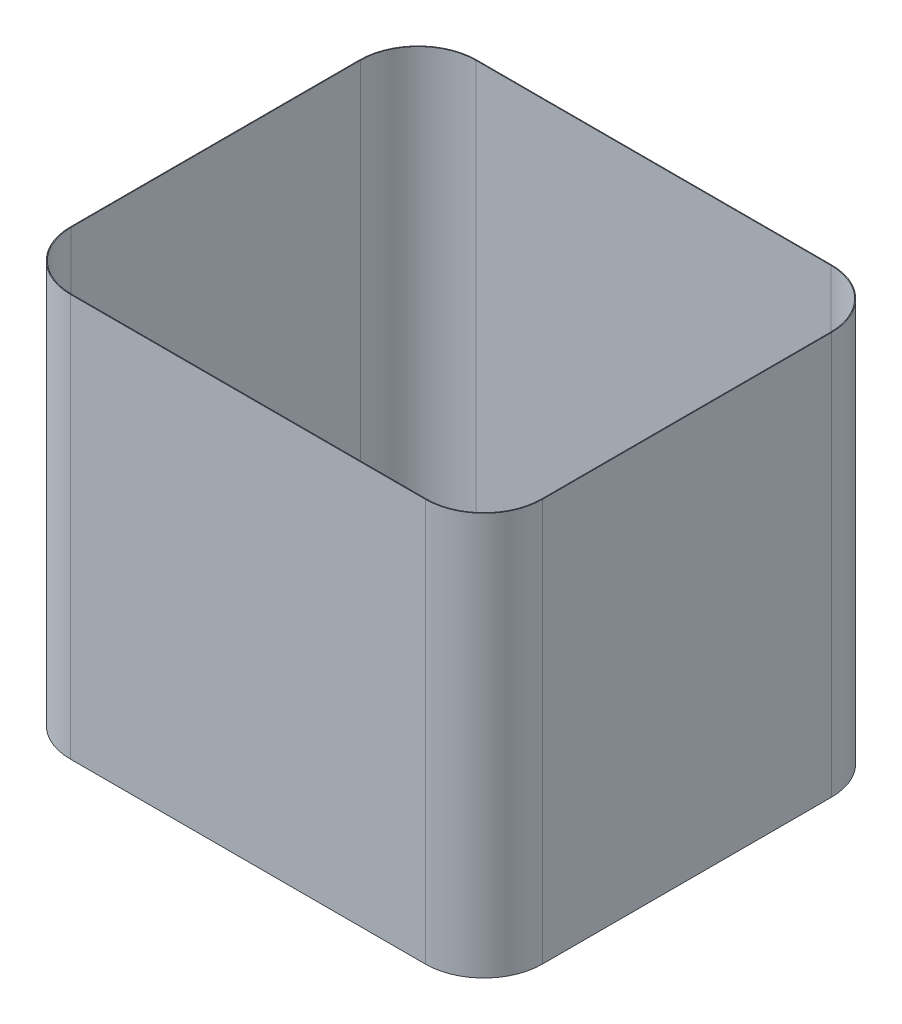
ISO-10303-21;
HEADER;
FILE_DESCRIPTION(('STEP AP214'),'2;1');
FILE_NAME('part.step','',(''),(''),'','','');
FILE_SCHEMA(('AUTOMOTIVE_DESIGN { 1 0 10303 214 1 1 1 1 }'));
ENDSEC;
DATA;
#1=APPLICATION_CONTEXT('core data for automotive mechanical design processes');
#2=APPLICATION_PROTOCOL_DEFINITION('international standard','automotive_design',2000,#1);
#3=PRODUCT_CONTEXT('',#1,'mechanical');
#4=PRODUCT('Part','Part','',(#3));
#5=PRODUCT_RELATED_PRODUCT_CATEGORY('part','',(#4));
#6=PRODUCT_DEFINITION_FORMATION('','',#4);
#7=PRODUCT_DEFINITION_CONTEXT('part definition',#1,'design');
#8=PRODUCT_DEFINITION('design','',#6,#7);
#9=PRODUCT_DEFINITION_SHAPE('','',#8);
#10=(LENGTH_UNIT() NAMED_UNIT(*) SI_UNIT(.MILLI.,.METRE.));
#11=(NAMED_UNIT(*) PLANE_ANGLE_UNIT() SI_UNIT($,.RADIAN.));
#12=(NAMED_UNIT(*) SI_UNIT($,.STERADIAN.) SOLID_ANGLE_UNIT());
#13=UNCERTAINTY_MEASURE_WITH_UNIT(LENGTH_MEASURE(1.E-05),#10,'distance_accuracy_value','');
#14=(GEOMETRIC_REPRESENTATION_CONTEXT(3) GLOBAL_UNCERTAINTY_ASSIGNED_CONTEXT((#13)) GLOBAL_UNIT_ASSIGNED_CONTEXT((#10,
#11,#12)) REPRESENTATION_CONTEXT('',''));
#15=CARTESIAN_POINT('',(0.,0.,0.));
#16=DIRECTION('',(0.,0.,1.));
#17=DIRECTION('',(1.,0.,0.));
#18=AXIS2_PLACEMENT_3D('',#15,#16,#17);
#19=CARTESIAN_POINT('',(-203.2,0.,203.2));
#20=DIRECTION('',(0.,-1.,0.));
#21=DIRECTION('',(0.,0.,-1.));
#22=AXIS2_PLACEMENT_3D('',#19,#20,#21);
#23=PLANE('',#22);
#24=CARTESIAN_POINT('',(-203.2,0.,203.2));
#25=DIRECTION('',(0.,1.,0.));
#26=DIRECTION('',(0.,0.,-1.));
#27=AXIS2_PLACEMENT_3D('',#24,#25,#26);
#28=CIRCLE('',#27,203.2);
#29=CARTESIAN_POINT('',(-406.4,0.,203.199999999999));
#30=VERTEX_POINT('',#29);
#31=CARTESIAN_POINT('',(-203.199999999999,0.,406.4));
#32=VERTEX_POINT('',#31);
#33=EDGE_CURVE('E177',#30,#32,#28,.T.);
#34=ORIENTED_EDGE('',*,*,#33,.F.);
#35=DIRECTION('',(0.,0.,1.));
#36=VECTOR('',#35,1.);
#37=CARTESIAN_POINT('',(-406.4,0.,203.199999999999));
#38=LINE('',#37,#36);
#39=CARTESIAN_POINT('',(-406.4,0.,-800.099999999999));
#40=VERTEX_POINT('',#39);
#41=EDGE_CURVE('E212',#40,#30,#38,.T.);
#42=ORIENTED_EDGE('',*,*,#41,.F.);
#43=CARTESIAN_POINT('',(-203.2,0.,-800.1));
#44=DIRECTION('',(0.,1.,0.));
#45=DIRECTION('',(0.,0.,1.));
#46=AXIS2_PLACEMENT_3D('',#43,#44,#45);
#47=CIRCLE('',#46,203.2);
#48=CARTESIAN_POINT('',(-203.199999999999,0.,-1003.3));
#49=VERTEX_POINT('',#48);
#50=EDGE_CURVE('E239',#49,#40,#47,.T.);
#51=ORIENTED_EDGE('',*,*,#50,.F.);
#52=DIRECTION('',(-1.,0.,0.));
#53=VECTOR('',#52,1.);
#54=CARTESIAN_POINT('',(-203.199999999999,0.,-1003.3));
#55=LINE('',#54,#53);
#56=CARTESIAN_POINT('',(1028.7,0.,-1003.3));
#57=VERTEX_POINT('',#56);
#58=EDGE_CURVE('E237',#57,#49,#55,.T.);
#59=ORIENTED_EDGE('',*,*,#58,.F.);
#60=CARTESIAN_POINT('',(1028.7,0.,-800.1));
#61=DIRECTION('',(0.,1.,0.));
#62=DIRECTION('',(0.,0.,1.));
#63=AXIS2_PLACEMENT_3D('',#60,#61,#62);
#64=CIRCLE('',#63,203.2);
#65=CARTESIAN_POINT('',(1231.9,0.,-800.099999999998));
#66=VERTEX_POINT('',#65);
#67=EDGE_CURVE('E235',#66,#57,#64,.T.);
#68=ORIENTED_EDGE('',*,*,#67,.F.);
#69=DIRECTION('',(0.,0.,-1.));
#70=VECTOR('',#69,1.);
#71=CARTESIAN_POINT('',(1231.9,0.,203.199999999999));
#72=LINE('',#71,#70);
#73=CARTESIAN_POINT('',(1231.9,0.,203.199999999999));
#74=VERTEX_POINT('',#73);
#75=EDGE_CURVE('E233',#74,#66,#72,.T.);
#76=ORIENTED_EDGE('',*,*,#75,.F.);
#77=CARTESIAN_POINT('',(1028.7,0.,203.2));
#78=DIRECTION('',(0.,1.,0.));
#79=DIRECTION('',(0.,0.,1.));
#80=AXIS2_PLACEMENT_3D('',#77,#78,#79);
#81=CIRCLE('',#80,203.2);
#82=CARTESIAN_POINT('',(1028.7,0.,406.4));
#83=VERTEX_POINT('',#82);
#84=EDGE_CURVE('E231',#83,#74,#81,.T.);
#85=ORIENTED_EDGE('',*,*,#84,.F.);
#86=DIRECTION('',(1.,0.,0.));
#87=VECTOR('',#86,1.);
#88=CARTESIAN_POINT('',(-203.199999999999,0.,406.4));
#89=LINE('',#88,#87);
#90=EDGE_CURVE('E229',#32,#83,#89,.T.);
#91=ORIENTED_EDGE('',*,*,#90,.F.);
#92=EDGE_LOOP('',(#34,#42,#51,#59,#68,#76,#85,#91));
#93=FACE_BOUND('',#92,.T.);
#94=DIRECTION('',(0.,0.,1.));
#95=VECTOR('',#94,1.);
#96=CARTESIAN_POINT('',(-403.86,0.,203.2));
#97=LINE('',#96,#95);
#98=CARTESIAN_POINT('',(-403.86,0.,-800.099999999998));
#99=VERTEX_POINT('',#98);
#100=CARTESIAN_POINT('',(-403.86,0.,203.199999999999));
#101=VERTEX_POINT('',#100);
#102=EDGE_CURVE('E158',#99,#101,#97,.T.);
#103=ORIENTED_EDGE('',*,*,#102,.T.);
#104=CARTESIAN_POINT('',(-203.2,0.,203.2));
#105=DIRECTION('',(0.,-1.,0.));
#106=DIRECTION('',(0.,0.,-1.));
#107=AXIS2_PLACEMENT_3D('',#104,#105,#106);
#108=CIRCLE('',#107,200.66);
#109=CARTESIAN_POINT('',(-203.199999999999,0.,403.86));
#110=VERTEX_POINT('',#109);
#111=EDGE_CURVE('E156',#101,#110,#108,.F.);
#112=ORIENTED_EDGE('',*,*,#111,.T.);
#113=DIRECTION('',(1.,0.,0.));
#114=VECTOR('',#113,1.);
#115=CARTESIAN_POINT('',(-203.2,0.,403.86));
#116=LINE('',#115,#114);
#117=CARTESIAN_POINT('',(1028.7,0.,403.86));
#118=VERTEX_POINT('',#117);
#119=EDGE_CURVE('E191',#110,#118,#116,.T.);
#120=ORIENTED_EDGE('',*,*,#119,.T.);
#121=CARTESIAN_POINT('',(1028.7,0.,203.2));
#122=DIRECTION('',(0.,-1.,0.));
#123=DIRECTION('',(0.,0.,-1.));
#124=AXIS2_PLACEMENT_3D('',#121,#122,#123);
#125=CIRCLE('',#124,200.66);
#126=CARTESIAN_POINT('',(1229.36,0.,203.199999999999));
#127=VERTEX_POINT('',#126);
#128=EDGE_CURVE('E58',#118,#127,#125,.F.);
#129=ORIENTED_EDGE('',*,*,#128,.T.);
#130=DIRECTION('',(0.,0.,-1.));
#131=VECTOR('',#130,1.);
#132=CARTESIAN_POINT('',(1229.36,0.,203.2));
#133=LINE('',#132,#131);
#134=CARTESIAN_POINT('',(1229.36,0.,-800.099999999998));
#135=VERTEX_POINT('',#134);
#136=EDGE_CURVE('E202',#127,#135,#133,.T.);
#137=ORIENTED_EDGE('',*,*,#136,.T.);
#138=CARTESIAN_POINT('',(1028.7,0.,-800.1));
#139=DIRECTION('',(0.,-1.,0.));
#140=DIRECTION('',(0.,0.,-1.));
#141=AXIS2_PLACEMENT_3D('',#138,#139,#140);
#142=CIRCLE('',#141,200.66);
#143=CARTESIAN_POINT('',(1028.7,0.,-1000.76));
#144=VERTEX_POINT('',#143);
#145=EDGE_CURVE('E199',#135,#144,#142,.F.);
#146=ORIENTED_EDGE('',*,*,#145,.T.);
#147=DIRECTION('',(-1.,0.,0.));
#148=VECTOR('',#147,1.);
#149=CARTESIAN_POINT('',(-203.2,0.,-1000.76));
#150=LINE('',#149,#148);
#151=CARTESIAN_POINT('',(-203.199999999999,0.,-1000.76));
#152=VERTEX_POINT('',#151);
#153=EDGE_CURVE('E196',#144,#152,#150,.T.);
#154=ORIENTED_EDGE('',*,*,#153,.T.);
#155=CARTESIAN_POINT('',(-203.2,0.,-800.1));
#156=DIRECTION('',(0.,-1.,0.));
#157=DIRECTION('',(0.,0.,-1.));
#158=AXIS2_PLACEMENT_3D('',#155,#156,#157);
#159=CIRCLE('',#158,200.66);
#160=EDGE_CURVE('E193',#152,#99,#159,.F.);
#161=ORIENTED_EDGE('',*,*,#160,.T.);
#162=EDGE_LOOP('',(#103,#112,#120,#129,#137,#146,#154,#161));
#163=FACE_BOUND('',#162,.T.);
#164=ADVANCED_FACE('F35',(#93,#163),#23,.T.);
#165=CARTESIAN_POINT('',(-203.2,1397.,203.2));
#166=DIRECTION('',(0.,-1.,0.));
#167=DIRECTION('',(0.,0.,-1.));
#168=AXIS2_PLACEMENT_3D('',#165,#166,#167);
#169=CYLINDRICAL_SURFACE('',#168,203.2);
#170=ORIENTED_EDGE('',*,*,#33,.T.);
#171=DIRECTION('',(0.,-1.,0.));
#172=VECTOR('',#171,1.);
#173=CARTESIAN_POINT('',(-203.199999999999,1397.,406.4));
#174=LINE('',#173,#172);
#175=CARTESIAN_POINT('',(-203.199999999999,1397.,406.4));
#176=VERTEX_POINT('',#175);
#177=EDGE_CURVE('E11',#176,#32,#174,.T.);
#178=ORIENTED_EDGE('',*,*,#177,.F.);
#179=CARTESIAN_POINT('',(-203.2,1397.,203.2));
#180=DIRECTION('',(0.,1.,0.));
#181=DIRECTION('',(0.,0.,-1.));
#182=AXIS2_PLACEMENT_3D('',#179,#180,#181);
#183=CIRCLE('',#182,203.2);
#184=CARTESIAN_POINT('',(-406.4,1397.,203.199999999999));
#185=VERTEX_POINT('',#184);
#186=EDGE_CURVE('E208',#185,#176,#183,.T.);
#187=ORIENTED_EDGE('',*,*,#186,.F.);
#188=DIRECTION('',(0.,-1.,0.));
#189=VECTOR('',#188,1.);
#190=CARTESIAN_POINT('',(-406.4,1397.,203.199999999999));
#191=LINE('',#190,#189);
#192=EDGE_CURVE('E226',#185,#30,#191,.T.);
#193=ORIENTED_EDGE('',*,*,#192,.T.);
#194=EDGE_LOOP('',(#170,#178,#187,#193));
#195=FACE_BOUND('',#194,.T.);
#196=ADVANCED_FACE('F37',(#195),#169,.T.);
#197=CARTESIAN_POINT('',(-203.199999999999,1397.,406.4));
#198=DIRECTION('',(0.,0.,-1.));
#199=DIRECTION('',(-1.,0.,0.));
#200=AXIS2_PLACEMENT_3D('',#197,#198,#199);
#201=PLANE('',#200);
#202=ORIENTED_EDGE('',*,*,#90,.T.);
#203=DIRECTION('',(0.,-1.,0.));
#204=VECTOR('',#203,1.);
#205=CARTESIAN_POINT('',(1028.7,1397.,406.4));
#206=LINE('',#205,#204);
#207=CARTESIAN_POINT('',(1028.7,1397.,406.4));
#208=VERTEX_POINT('',#207);
#209=EDGE_CURVE('E43',#208,#83,#206,.T.);
#210=ORIENTED_EDGE('',*,*,#209,.F.);
#211=DIRECTION('',(1.,0.,0.));
#212=VECTOR('',#211,1.);
#213=CARTESIAN_POINT('',(-203.199999999999,1397.,406.4));
#214=LINE('',#213,#212);
#215=EDGE_CURVE('E211',#176,#208,#214,.T.);
#216=ORIENTED_EDGE('',*,*,#215,.F.);
#217=ORIENTED_EDGE('',*,*,#177,.T.);
#218=EDGE_LOOP('',(#202,#210,#216,#217));
#219=FACE_BOUND('',#218,.T.);
#220=ADVANCED_FACE('F284',(#219),#201,.F.);
#221=CARTESIAN_POINT('',(1028.7,1397.,203.2));
#222=DIRECTION('',(0.,-1.,0.));
#223=DIRECTION('',(0.,0.,-1.));
#224=AXIS2_PLACEMENT_3D('',#221,#222,#223);
#225=CYLINDRICAL_SURFACE('',#224,203.2);
#226=ORIENTED_EDGE('',*,*,#84,.T.);
#227=DIRECTION('',(0.,-1.,0.));
#228=VECTOR('',#227,1.);
#229=CARTESIAN_POINT('',(1231.9,1397.,203.199999999999));
#230=LINE('',#229,#228);
#231=CARTESIAN_POINT('',(1231.9,1397.,203.199999999999));
#232=VERTEX_POINT('',#231);
#233=EDGE_CURVE('E256',#232,#74,#230,.T.);
#234=ORIENTED_EDGE('',*,*,#233,.F.);
#235=CARTESIAN_POINT('',(1028.7,1397.,203.2));
#236=DIRECTION('',(0.,1.,0.));
#237=DIRECTION('',(0.,0.,1.));
#238=AXIS2_PLACEMENT_3D('',#235,#236,#237);
#239=CIRCLE('',#238,203.2);
#240=EDGE_CURVE('E214',#208,#232,#239,.T.);
#241=ORIENTED_EDGE('',*,*,#240,.F.);
#242=ORIENTED_EDGE('',*,*,#209,.T.);
#243=EDGE_LOOP('',(#226,#234,#241,#242));
#244=FACE_BOUND('',#243,.T.);
#245=ADVANCED_FACE('F263',(#244),#225,.T.);
#246=CARTESIAN_POINT('',(1231.9,1397.,203.199999999999));
#247=DIRECTION('',(-1.,0.,0.));
#248=DIRECTION('',(0.,0.,1.));
#249=AXIS2_PLACEMENT_3D('',#246,#247,#248);
#250=PLANE('',#249);
#251=ORIENTED_EDGE('',*,*,#75,.T.);
#252=DIRECTION('',(0.,-1.,0.));
#253=VECTOR('',#252,1.);
#254=CARTESIAN_POINT('',(1231.9,1397.,-800.099999999998));
#255=LINE('',#254,#253);
#256=CARTESIAN_POINT('',(1231.9,1397.,-800.099999999998));
#257=VERTEX_POINT('',#256);
#258=EDGE_CURVE('E253',#257,#66,#255,.T.);
#259=ORIENTED_EDGE('',*,*,#258,.F.);
#260=DIRECTION('',(0.,0.,-1.));
#261=VECTOR('',#260,1.);
#262=CARTESIAN_POINT('',(1231.9,1397.,203.199999999999));
#263=LINE('',#262,#261);
#264=EDGE_CURVE('E216',#232,#257,#263,.T.);
#265=ORIENTED_EDGE('',*,*,#264,.F.);
#266=ORIENTED_EDGE('',*,*,#233,.T.);
#267=EDGE_LOOP('',(#251,#259,#265,#266));
#268=FACE_BOUND('',#267,.T.);
#269=ADVANCED_FACE('F274',(#268),#250,.F.);
#270=CARTESIAN_POINT('',(1028.7,1397.,-800.1));
#271=DIRECTION('',(0.,-1.,0.));
#272=DIRECTION('',(0.,0.,-1.));
#273=AXIS2_PLACEMENT_3D('',#270,#271,#272);
#274=CYLINDRICAL_SURFACE('',#273,203.2);
#275=ORIENTED_EDGE('',*,*,#67,.T.);
#276=DIRECTION('',(0.,-1.,0.));
#277=VECTOR('',#276,1.);
#278=CARTESIAN_POINT('',(1028.7,1397.,-1003.3));
#279=LINE('',#278,#277);
#280=CARTESIAN_POINT('',(1028.7,1397.,-1003.3));
#281=VERTEX_POINT('',#280);
#282=EDGE_CURVE('E250',#281,#57,#279,.T.);
#283=ORIENTED_EDGE('',*,*,#282,.F.);
#284=CARTESIAN_POINT('',(1028.7,1397.,-800.1));
#285=DIRECTION('',(0.,1.,0.));
#286=DIRECTION('',(0.,0.,1.));
#287=AXIS2_PLACEMENT_3D('',#284,#285,#286);
#288=CIRCLE('',#287,203.2);
#289=EDGE_CURVE('E218',#257,#281,#288,.T.);
#290=ORIENTED_EDGE('',*,*,#289,.F.);
#291=ORIENTED_EDGE('',*,*,#258,.T.);
#292=EDGE_LOOP('',(#275,#283,#290,#291));
#293=FACE_BOUND('',#292,.T.);
#294=ADVANCED_FACE('F278',(#293),#274,.T.);
#295=CARTESIAN_POINT('',(-203.199999999999,1397.,-1003.3));
#296=DIRECTION('',(0.,0.,1.));
#297=DIRECTION('',(1.,0.,0.));
#298=AXIS2_PLACEMENT_3D('',#295,#296,#297);
#299=PLANE('',#298);
#300=ORIENTED_EDGE('',*,*,#58,.T.);
#301=DIRECTION('',(0.,-1.,0.));
#302=VECTOR('',#301,1.);
#303=CARTESIAN_POINT('',(-203.199999999999,1397.,-1003.3));
#304=LINE('',#303,#302);
#305=CARTESIAN_POINT('',(-203.199999999999,1397.,-1003.3));
#306=VERTEX_POINT('',#305);
#307=EDGE_CURVE('E247',#306,#49,#304,.T.);
#308=ORIENTED_EDGE('',*,*,#307,.F.);
#309=DIRECTION('',(-1.,0.,0.));
#310=VECTOR('',#309,1.);
#311=CARTESIAN_POINT('',(-203.199999999999,1397.,-1003.3));
#312=LINE('',#311,#310);
#313=EDGE_CURVE('E220',#281,#306,#312,.T.);
#314=ORIENTED_EDGE('',*,*,#313,.F.);
#315=ORIENTED_EDGE('',*,*,#282,.T.);
#316=EDGE_LOOP('',(#300,#308,#314,#315));
#317=FACE_BOUND('',#316,.T.);
#318=ADVANCED_FACE('F297',(#317),#299,.F.);
#319=CARTESIAN_POINT('',(-203.2,1397.,-800.1));
#320=DIRECTION('',(0.,-1.,0.));
#321=DIRECTION('',(0.,0.,-1.));
#322=AXIS2_PLACEMENT_3D('',#319,#320,#321);
#323=CYLINDRICAL_SURFACE('',#322,203.2);
#324=ORIENTED_EDGE('',*,*,#50,.T.);
#325=DIRECTION('',(0.,-1.,0.));
#326=VECTOR('',#325,1.);
#327=CARTESIAN_POINT('',(-406.4,1397.,-800.099999999999));
#328=LINE('',#327,#326);
#329=CARTESIAN_POINT('',(-406.4,1397.,-800.099999999999));
#330=VERTEX_POINT('',#329);
#331=EDGE_CURVE('E244',#330,#40,#328,.T.);
#332=ORIENTED_EDGE('',*,*,#331,.F.);
#333=CARTESIAN_POINT('',(-203.2,1397.,-800.1));
#334=DIRECTION('',(0.,1.,0.));
#335=DIRECTION('',(0.,0.,1.));
#336=AXIS2_PLACEMENT_3D('',#333,#334,#335);
#337=CIRCLE('',#336,203.2);
#338=EDGE_CURVE('E222',#306,#330,#337,.T.);
#339=ORIENTED_EDGE('',*,*,#338,.F.);
#340=ORIENTED_EDGE('',*,*,#307,.T.);
#341=EDGE_LOOP('',(#324,#332,#339,#340));
#342=FACE_BOUND('',#341,.T.);
#343=ADVANCED_FACE('F295',(#342),#323,.T.);
#344=CARTESIAN_POINT('',(-406.4,1397.,203.199999999999));
#345=DIRECTION('',(1.,0.,0.));
#346=DIRECTION('',(0.,0.,-1.));
#347=AXIS2_PLACEMENT_3D('',#344,#345,#346);
#348=PLANE('',#347);
#349=ORIENTED_EDGE('',*,*,#41,.T.);
#350=ORIENTED_EDGE('',*,*,#192,.F.);
#351=DIRECTION('',(0.,0.,1.));
#352=VECTOR('',#351,1.);
#353=CARTESIAN_POINT('',(-406.4,1397.,203.199999999999));
#354=LINE('',#353,#352);
#355=EDGE_CURVE('E224',#330,#185,#354,.T.);
#356=ORIENTED_EDGE('',*,*,#355,.F.);
#357=ORIENTED_EDGE('',*,*,#331,.T.);
#358=EDGE_LOOP('',(#349,#350,#356,#357));
#359=FACE_BOUND('',#358,.T.);
#360=ADVANCED_FACE('F290',(#359),#348,.F.);
#361=CARTESIAN_POINT('',(-203.2,1397.,203.2));
#362=DIRECTION('',(0.,-1.,0.));
#363=DIRECTION('',(0.,0.,-1.));
#364=AXIS2_PLACEMENT_3D('',#361,#362,#363);
#365=PLANE('',#364);
#366=DIRECTION('',(1.,0.,0.));
#367=VECTOR('',#366,1.);
#368=CARTESIAN_POINT('',(1028.7,1397.,403.86));
#369=LINE('',#368,#367);
#370=CARTESIAN_POINT('',(-203.199999999999,1397.,403.86));
#371=VERTEX_POINT('',#370);
#372=CARTESIAN_POINT('',(1028.7,1397.,403.86));
#373=VERTEX_POINT('',#372);
#374=EDGE_CURVE('E170',#371,#373,#369,.T.);
#375=ORIENTED_EDGE('',*,*,#374,.F.);
#376=CARTESIAN_POINT('',(-203.2,1397.,203.2));
#377=DIRECTION('',(0.,-1.,0.));
#378=DIRECTION('',(0.,0.,-1.));
#379=AXIS2_PLACEMENT_3D('',#376,#377,#378);
#380=CIRCLE('',#379,200.66);
#381=CARTESIAN_POINT('',(-403.86,1397.,203.199999999999));
#382=VERTEX_POINT('',#381);
#383=EDGE_CURVE('E153',#382,#371,#380,.F.);
#384=ORIENTED_EDGE('',*,*,#383,.F.);
#385=DIRECTION('',(0.,0.,1.));
#386=VECTOR('',#385,1.);
#387=CARTESIAN_POINT('',(-403.86,1397.,203.199999999999));
#388=LINE('',#387,#386);
#389=CARTESIAN_POINT('',(-403.86,1397.,-800.099999999998));
#390=VERTEX_POINT('',#389);
#391=EDGE_CURVE('E161',#390,#382,#388,.T.);
#392=ORIENTED_EDGE('',*,*,#391,.F.);
#393=CARTESIAN_POINT('',(-203.2,1397.,-800.1));
#394=DIRECTION('',(0.,-1.,0.));
#395=DIRECTION('',(0.,0.,-1.));
#396=AXIS2_PLACEMENT_3D('',#393,#394,#395);
#397=CIRCLE('',#396,200.66);
#398=CARTESIAN_POINT('',(-203.199999999999,1397.,-1000.76));
#399=VERTEX_POINT('',#398);
#400=EDGE_CURVE('E484',#399,#390,#397,.F.);
#401=ORIENTED_EDGE('',*,*,#400,.F.);
#402=DIRECTION('',(-1.,0.,0.));
#403=VECTOR('',#402,1.);
#404=CARTESIAN_POINT('',(-203.199999999999,1397.,-1000.76));
#405=LINE('',#404,#403);
#406=CARTESIAN_POINT('',(1028.7,1397.,-1000.76));
#407=VERTEX_POINT('',#406);
#408=EDGE_CURVE('E481',#407,#399,#405,.T.);
#409=ORIENTED_EDGE('',*,*,#408,.F.);
#410=CARTESIAN_POINT('',(1028.7,1397.,-800.1));
#411=DIRECTION('',(0.,-1.,0.));
#412=DIRECTION('',(0.,0.,-1.));
#413=AXIS2_PLACEMENT_3D('',#410,#411,#412);
#414=CIRCLE('',#413,200.66);
#415=CARTESIAN_POINT('',(1229.36,1397.,-800.1));
#416=VERTEX_POINT('',#415);
#417=EDGE_CURVE('E483',#416,#407,#414,.F.);
#418=ORIENTED_EDGE('',*,*,#417,.F.);
#419=DIRECTION('',(0.,0.,-1.));
#420=VECTOR('',#419,1.);
#421=CARTESIAN_POINT('',(1229.36,1397.,-800.1));
#422=LINE('',#421,#420);
#423=CARTESIAN_POINT('',(1229.36,1397.,203.199999999999));
#424=VERTEX_POINT('',#423);
#425=EDGE_CURVE('E489',#424,#416,#422,.T.);
#426=ORIENTED_EDGE('',*,*,#425,.F.);
#427=CARTESIAN_POINT('',(1028.7,1397.,203.2));
#428=DIRECTION('',(0.,-1.,0.));
#429=DIRECTION('',(0.,0.,-1.));
#430=AXIS2_PLACEMENT_3D('',#427,#428,#429);
#431=CIRCLE('',#430,200.66);
#432=EDGE_CURVE('E172',#373,#424,#431,.F.);
#433=ORIENTED_EDGE('',*,*,#432,.F.);
#434=EDGE_LOOP('',(#375,#384,#392,#401,#409,#418,#426,#433));
#435=FACE_BOUND('',#434,.T.);
#436=ORIENTED_EDGE('',*,*,#186,.T.);
#437=ORIENTED_EDGE('',*,*,#215,.T.);
#438=ORIENTED_EDGE('',*,*,#240,.T.);
#439=ORIENTED_EDGE('',*,*,#264,.T.);
#440=ORIENTED_EDGE('',*,*,#289,.T.);
#441=ORIENTED_EDGE('',*,*,#313,.T.);
#442=ORIENTED_EDGE('',*,*,#338,.T.);
#443=ORIENTED_EDGE('',*,*,#355,.T.);
#444=EDGE_LOOP('',(#436,#437,#438,#439,#440,#441,#442,#443));
#445=FACE_BOUND('',#444,.T.);
#446=ADVANCED_FACE('F166',(#435,#445),#365,.F.);
#447=CARTESIAN_POINT('',(-203.2,1397.,203.2));
#448=DIRECTION('',(0.,-1.,0.));
#449=DIRECTION('',(0.,0.,-1.));
#450=AXIS2_PLACEMENT_3D('',#447,#448,#449);
#451=CYLINDRICAL_SURFACE('',#450,200.66);
#452=ORIENTED_EDGE('',*,*,#111,.F.);
#453=DIRECTION('',(0.,-1.,0.));
#454=VECTOR('',#453,1.);
#455=CARTESIAN_POINT('',(-403.86,1397.,203.199999999999));
#456=LINE('',#455,#454);
#457=EDGE_CURVE('E149',#382,#101,#456,.T.);
#458=ORIENTED_EDGE('',*,*,#457,.F.);
#459=ORIENTED_EDGE('',*,*,#383,.T.);
#460=DIRECTION('',(0.,1.,0.));
#461=VECTOR('',#460,1.);
#462=CARTESIAN_POINT('',(-203.199999999999,1397.,403.86));
#463=LINE('',#462,#461);
#464=EDGE_CURVE('E176',#371,#110,#463,.F.);
#465=ORIENTED_EDGE('',*,*,#464,.T.);
#466=EDGE_LOOP('',(#452,#458,#459,#465));
#467=FACE_BOUND('',#466,.T.);
#468=ADVANCED_FACE('F150',(#467),#451,.F.);
#469=CARTESIAN_POINT('',(-203.199999999999,1397.,403.86));
#470=DIRECTION('',(0.,0.,-1.));
#471=DIRECTION('',(-1.,0.,0.));
#472=AXIS2_PLACEMENT_3D('',#469,#470,#471);
#473=PLANE('',#472);
#474=ORIENTED_EDGE('',*,*,#119,.F.);
#475=ORIENTED_EDGE('',*,*,#464,.F.);
#476=ORIENTED_EDGE('',*,*,#374,.T.);
#477=DIRECTION('',(0.,-1.,0.));
#478=VECTOR('',#477,1.);
#479=CARTESIAN_POINT('',(1028.7,1397.,403.86));
#480=LINE('',#479,#478);
#481=EDGE_CURVE('E178',#373,#118,#480,.T.);
#482=ORIENTED_EDGE('',*,*,#481,.T.);
#483=EDGE_LOOP('',(#474,#475,#476,#482));
#484=FACE_BOUND('',#483,.T.);
#485=ADVANCED_FACE('F322',(#484),#473,.T.);
#486=CARTESIAN_POINT('',(1028.7,1397.,203.2));
#487=DIRECTION('',(0.,-1.,0.));
#488=DIRECTION('',(0.,0.,-1.));
#489=AXIS2_PLACEMENT_3D('',#486,#487,#488);
#490=CYLINDRICAL_SURFACE('',#489,200.66);
#491=ORIENTED_EDGE('',*,*,#128,.F.);
#492=ORIENTED_EDGE('',*,*,#481,.F.);
#493=ORIENTED_EDGE('',*,*,#432,.T.);
#494=DIRECTION('',(0.,1.,0.));
#495=VECTOR('',#494,1.);
#496=CARTESIAN_POINT('',(1229.36,1397.,203.199999999999));
#497=LINE('',#496,#495);
#498=EDGE_CURVE('E181',#424,#127,#497,.F.);
#499=ORIENTED_EDGE('',*,*,#498,.T.);
#500=EDGE_LOOP('',(#491,#492,#493,#499));
#501=FACE_BOUND('',#500,.T.);
#502=ADVANCED_FACE('F327',(#501),#490,.F.);
#503=CARTESIAN_POINT('',(1229.36,1397.,203.199999999999));
#504=DIRECTION('',(-1.,0.,0.));
#505=DIRECTION('',(0.,0.,1.));
#506=AXIS2_PLACEMENT_3D('',#503,#504,#505);
#507=PLANE('',#506);
#508=ORIENTED_EDGE('',*,*,#136,.F.);
#509=ORIENTED_EDGE('',*,*,#498,.F.);
#510=ORIENTED_EDGE('',*,*,#425,.T.);
#511=DIRECTION('',(0.,-1.,0.));
#512=VECTOR('',#511,1.);
#513=CARTESIAN_POINT('',(1229.36,1397.,-800.099999999998));
#514=LINE('',#513,#512);
#515=EDGE_CURVE('E183',#416,#135,#514,.T.);
#516=ORIENTED_EDGE('',*,*,#515,.T.);
#517=EDGE_LOOP('',(#508,#509,#510,#516));
#518=FACE_BOUND('',#517,.T.);
#519=ADVANCED_FACE('F333',(#518),#507,.T.);
#520=CARTESIAN_POINT('',(1028.7,1397.,-800.1));
#521=DIRECTION('',(0.,-1.,0.));
#522=DIRECTION('',(0.,0.,-1.));
#523=AXIS2_PLACEMENT_3D('',#520,#521,#522);
#524=CYLINDRICAL_SURFACE('',#523,200.66);
#525=ORIENTED_EDGE('',*,*,#145,.F.);
#526=ORIENTED_EDGE('',*,*,#515,.F.);
#527=ORIENTED_EDGE('',*,*,#417,.T.);
#528=DIRECTION('',(0.,1.,0.));
#529=VECTOR('',#528,1.);
#530=CARTESIAN_POINT('',(1028.7,1397.,-1000.76));
#531=LINE('',#530,#529);
#532=EDGE_CURVE('E185',#407,#144,#531,.F.);
#533=ORIENTED_EDGE('',*,*,#532,.T.);
#534=EDGE_LOOP('',(#525,#526,#527,#533));
#535=FACE_BOUND('',#534,.T.);
#536=ADVANCED_FACE('F336',(#535),#524,.F.);
#537=CARTESIAN_POINT('',(-203.199999999999,1397.,-1000.76));
#538=DIRECTION('',(0.,0.,1.));
#539=DIRECTION('',(1.,0.,0.));
#540=AXIS2_PLACEMENT_3D('',#537,#538,#539);
#541=PLANE('',#540);
#542=ORIENTED_EDGE('',*,*,#153,.F.);
#543=ORIENTED_EDGE('',*,*,#532,.F.);
#544=ORIENTED_EDGE('',*,*,#408,.T.);
#545=DIRECTION('',(0.,-1.,0.));
#546=VECTOR('',#545,1.);
#547=CARTESIAN_POINT('',(-203.199999999999,1397.,-1000.76));
#548=LINE('',#547,#546);
#549=EDGE_CURVE('E187',#399,#152,#548,.T.);
#550=ORIENTED_EDGE('',*,*,#549,.T.);
#551=EDGE_LOOP('',(#542,#543,#544,#550));
#552=FACE_BOUND('',#551,.T.);
#553=ADVANCED_FACE('F340',(#552),#541,.T.);
#554=CARTESIAN_POINT('',(-203.2,1397.,-800.1));
#555=DIRECTION('',(0.,-1.,0.));
#556=DIRECTION('',(0.,0.,-1.));
#557=AXIS2_PLACEMENT_3D('',#554,#555,#556);
#558=CYLINDRICAL_SURFACE('',#557,200.66);
#559=ORIENTED_EDGE('',*,*,#160,.F.);
#560=ORIENTED_EDGE('',*,*,#549,.F.);
#561=ORIENTED_EDGE('',*,*,#400,.T.);
#562=DIRECTION('',(0.,1.,0.));
#563=VECTOR('',#562,1.);
#564=CARTESIAN_POINT('',(-403.86,1397.,-800.099999999999));
#565=LINE('',#564,#563);
#566=EDGE_CURVE('E50',#390,#99,#565,.F.);
#567=ORIENTED_EDGE('',*,*,#566,.T.);
#568=EDGE_LOOP('',(#559,#560,#561,#567));
#569=FACE_BOUND('',#568,.T.);
#570=ADVANCED_FACE('F344',(#569),#558,.F.);
#571=CARTESIAN_POINT('',(-403.86,1397.,203.199999999999));
#572=DIRECTION('',(1.,0.,0.));
#573=DIRECTION('',(0.,0.,-1.));
#574=AXIS2_PLACEMENT_3D('',#571,#572,#573);
#575=PLANE('',#574);
#576=ORIENTED_EDGE('',*,*,#102,.F.);
#577=ORIENTED_EDGE('',*,*,#566,.F.);
#578=ORIENTED_EDGE('',*,*,#391,.T.);
#579=ORIENTED_EDGE('',*,*,#457,.T.);
#580=EDGE_LOOP('',(#576,#577,#578,#579));
#581=FACE_BOUND('',#580,.T.);
#582=ADVANCED_FACE('F162',(#581),#575,.T.);
#583=CLOSED_SHELL('',(#164,#196,#220,#245,#269,#294,#318,#343,#360,#446,#468,#485,#502,#519,
#536,#553,#570,#582));
#584=MANIFOLD_SOLID_BREP('B2',#583);
#585=ADVANCED_BREP_SHAPE_REPRESENTATION('',(#18,#584),#14);
#586=SHAPE_DEFINITION_REPRESENTATION(#9,#585);
ENDSEC;
END-ISO-10303-21;
